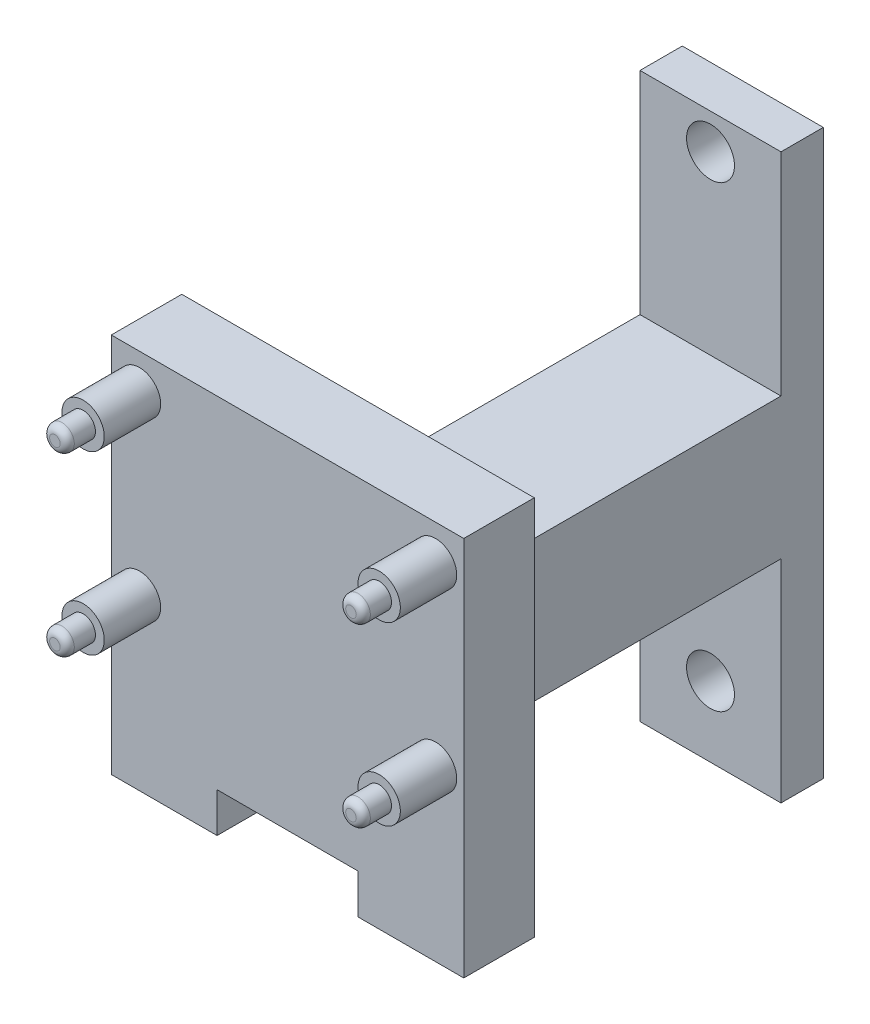
ISO-10303-21;
HEADER;
FILE_DESCRIPTION(('STEP AP214'),'2;1');
FILE_NAME('part.step','',(''),(''),'','','');
FILE_SCHEMA(('AUTOMOTIVE_DESIGN { 1 0 10303 214 1 1 1 1 }'));
ENDSEC;
DATA;
#1=APPLICATION_CONTEXT('core data for automotive mechanical design processes');
#2=APPLICATION_PROTOCOL_DEFINITION('international standard','automotive_design',2000,#1);
#3=PRODUCT_CONTEXT('',#1,'mechanical');
#4=PRODUCT('Part','Part','',(#3));
#5=PRODUCT_RELATED_PRODUCT_CATEGORY('part','',(#4));
#6=PRODUCT_DEFINITION_FORMATION('','',#4);
#7=PRODUCT_DEFINITION_CONTEXT('part definition',#1,'design');
#8=PRODUCT_DEFINITION('design','',#6,#7);
#9=PRODUCT_DEFINITION_SHAPE('','',#8);
#10=(LENGTH_UNIT() NAMED_UNIT(*) SI_UNIT(.MILLI.,.METRE.));
#11=(NAMED_UNIT(*) PLANE_ANGLE_UNIT() SI_UNIT($,.RADIAN.));
#12=(NAMED_UNIT(*) SI_UNIT($,.STERADIAN.) SOLID_ANGLE_UNIT());
#13=UNCERTAINTY_MEASURE_WITH_UNIT(LENGTH_MEASURE(1.E-05),#10,'distance_accuracy_value','');
#14=(GEOMETRIC_REPRESENTATION_CONTEXT(3) GLOBAL_UNCERTAINTY_ASSIGNED_CONTEXT((#13)) GLOBAL_UNIT_ASSIGNED_CONTEXT((#10,
#11,#12)) REPRESENTATION_CONTEXT('',''));
#15=CARTESIAN_POINT('',(0.,0.,0.));
#16=DIRECTION('',(0.,0.,1.));
#17=DIRECTION('',(1.,0.,0.));
#18=AXIS2_PLACEMENT_3D('',#15,#16,#17);
#19=CARTESIAN_POINT('',(-7.5,7.99999999999999,33.));
#20=DIRECTION('',(0.,1.,0.));
#21=DIRECTION('',(-1.,0.,0.));
#22=AXIS2_PLACEMENT_3D('',#19,#20,#21);
#23=PLANE('',#22);
#24=DIRECTION('',(0.,0.,1.));
#25=VECTOR('',#24,1.);
#26=CARTESIAN_POINT('',(10.,8.,23.));
#27=LINE('',#26,#25);
#28=CARTESIAN_POINT('',(10.,8.,28.));
#29=VERTEX_POINT('',#28);
#30=CARTESIAN_POINT('',(10.,8.,33.));
#31=VERTEX_POINT('',#30);
#32=EDGE_CURVE('E192',#29,#31,#27,.T.);
#33=ORIENTED_EDGE('',*,*,#32,.F.);
#34=DIRECTION('',(1.,0.,0.));
#35=VECTOR('',#34,1.);
#36=CARTESIAN_POINT('',(-7.5,7.99999999999999,28.));
#37=LINE('',#36,#35);
#38=CARTESIAN_POINT('',(17.5000000000001,7.99999999999996,28.));
#39=VERTEX_POINT('',#38);
#40=EDGE_CURVE('E215',#29,#39,#37,.T.);
#41=ORIENTED_EDGE('',*,*,#40,.T.);
#42=DIRECTION('',(0.,0.,-1.));
#43=VECTOR('',#42,1.);
#44=CARTESIAN_POINT('',(17.5,8.,33.));
#45=LINE('',#44,#43);
#46=CARTESIAN_POINT('',(17.5,8.,33.));
#47=VERTEX_POINT('',#46);
#48=EDGE_CURVE('E223',#47,#39,#45,.T.);
#49=ORIENTED_EDGE('',*,*,#48,.F.);
#50=DIRECTION('',(1.,0.,0.));
#51=VECTOR('',#50,1.);
#52=CARTESIAN_POINT('',(-7.5,7.99999999999999,33.));
#53=LINE('',#52,#51);
#54=EDGE_CURVE('E204',#31,#47,#53,.T.);
#55=ORIENTED_EDGE('',*,*,#54,.F.);
#56=EDGE_LOOP('',(#33,#41,#49,#55));
#57=FACE_BOUND('',#56,.T.);
#58=ADVANCED_FACE('F43',(#57),#23,.F.);
#59=CARTESIAN_POINT('',(0.,0.,33.));
#60=DIRECTION('',(0.,0.,-1.));
#61=DIRECTION('',(-1.,0.,0.));
#62=AXIS2_PLACEMENT_3D('',#59,#60,#61);
#63=PLANE('',#62);
#64=CARTESIAN_POINT('',(-5.5,32.5,33.));
#65=DIRECTION('',(0.,0.,-1.));
#66=DIRECTION('',(-1.,0.,0.));
#67=AXIS2_PLACEMENT_3D('',#64,#65,#66);
#68=CIRCLE('',#67,1.5);
#69=CARTESIAN_POINT('',(-7.,32.5,33.));
#70=VERTEX_POINT('',#69);
#71=EDGE_CURVE('E379',#70,#70,#68,.T.);
#72=ORIENTED_EDGE('',*,*,#71,.T.);
#73=EDGE_LOOP('',(#72));
#74=FACE_BOUND('',#73,.T.);
#75=CARTESIAN_POINT('',(15.5,32.5,33.));
#76=DIRECTION('',(0.,0.,-1.));
#77=DIRECTION('',(-1.,0.,0.));
#78=AXIS2_PLACEMENT_3D('',#75,#76,#77);
#79=CIRCLE('',#78,1.5);
#80=CARTESIAN_POINT('',(14.,32.5,33.));
#81=VERTEX_POINT('',#80);
#82=EDGE_CURVE('E384',#81,#81,#79,.T.);
#83=ORIENTED_EDGE('',*,*,#82,.T.);
#84=EDGE_LOOP('',(#83));
#85=FACE_BOUND('',#84,.T.);
#86=CARTESIAN_POINT('',(15.5,20.,33.));
#87=DIRECTION('',(0.,0.,-1.));
#88=DIRECTION('',(-1.,0.,0.));
#89=AXIS2_PLACEMENT_3D('',#86,#87,#88);
#90=CIRCLE('',#89,1.5);
#91=CARTESIAN_POINT('',(14.,20.,33.));
#92=VERTEX_POINT('',#91);
#93=EDGE_CURVE('E388',#92,#92,#90,.T.);
#94=ORIENTED_EDGE('',*,*,#93,.T.);
#95=EDGE_LOOP('',(#94));
#96=FACE_BOUND('',#95,.T.);
#97=CARTESIAN_POINT('',(-5.5,20.,33.));
#98=DIRECTION('',(0.,0.,-1.));
#99=DIRECTION('',(-1.,0.,0.));
#100=AXIS2_PLACEMENT_3D('',#97,#98,#99);
#101=CIRCLE('',#100,1.5);
#102=CARTESIAN_POINT('',(-7.,20.,33.));
#103=VERTEX_POINT('',#102);
#104=EDGE_CURVE('E386',#103,#103,#101,.T.);
#105=ORIENTED_EDGE('',*,*,#104,.T.);
#106=EDGE_LOOP('',(#105));
#107=FACE_BOUND('',#106,.T.);
#108=DIRECTION('',(0.,-1.,0.));
#109=VECTOR('',#108,1.);
#110=CARTESIAN_POINT('',(0.,10.8195886018041,33.));
#111=LINE('',#110,#109);
#112=CARTESIAN_POINT('',(0.,10.8195886018041,33.));
#113=VERTEX_POINT('',#112);
#114=CARTESIAN_POINT('',(0.,8.,33.));
#115=VERTEX_POINT('',#114);
#116=EDGE_CURVE('E174',#113,#115,#111,.T.);
#117=ORIENTED_EDGE('',*,*,#116,.F.);
#118=DIRECTION('',(-1.,0.,0.));
#119=VECTOR('',#118,1.);
#120=CARTESIAN_POINT('',(0.,10.8195886018041,33.));
#121=LINE('',#120,#119);
#122=CARTESIAN_POINT('',(10.,10.8195886018041,33.));
#123=VERTEX_POINT('',#122);
#124=EDGE_CURVE('E194',#123,#113,#121,.T.);
#125=ORIENTED_EDGE('',*,*,#124,.F.);
#126=DIRECTION('',(0.,1.,0.));
#127=VECTOR('',#126,1.);
#128=CARTESIAN_POINT('',(10.,10.8195886018041,33.));
#129=LINE('',#128,#127);
#130=EDGE_CURVE('E184',#31,#123,#129,.T.);
#131=ORIENTED_EDGE('',*,*,#130,.F.);
#132=ORIENTED_EDGE('',*,*,#54,.T.);
#133=DIRECTION('',(0.,1.,0.));
#134=VECTOR('',#133,1.);
#135=CARTESIAN_POINT('',(17.5,8.,33.));
#136=LINE('',#135,#134);
#137=CARTESIAN_POINT('',(17.5,35.,33.));
#138=VERTEX_POINT('',#137);
#139=EDGE_CURVE('E199',#47,#138,#136,.T.);
#140=ORIENTED_EDGE('',*,*,#139,.T.);
#141=DIRECTION('',(-1.,0.,0.));
#142=VECTOR('',#141,1.);
#143=CARTESIAN_POINT('',(-7.5,35.,33.));
#144=LINE('',#143,#142);
#145=CARTESIAN_POINT('',(-7.5,35.,33.));
#146=VERTEX_POINT('',#145);
#147=EDGE_CURVE('E205',#138,#146,#144,.T.);
#148=ORIENTED_EDGE('',*,*,#147,.T.);
#149=DIRECTION('',(0.,-1.,0.));
#150=VECTOR('',#149,1.);
#151=CARTESIAN_POINT('',(-7.5,7.99999999999999,33.));
#152=LINE('',#151,#150);
#153=CARTESIAN_POINT('',(-7.5,7.99999999999999,33.));
#154=VERTEX_POINT('',#153);
#155=EDGE_CURVE('E197',#146,#154,#152,.T.);
#156=ORIENTED_EDGE('',*,*,#155,.T.);
#157=EDGE_CURVE('E188',#154,#115,#53,.T.);
#158=ORIENTED_EDGE('',*,*,#157,.T.);
#159=EDGE_LOOP('',(#117,#125,#131,#132,#140,#148,#156,#158));
#160=FACE_BOUND('',#159,.T.);
#161=ADVANCED_FACE('F200',(#74,#85,#96,#107,#160),#63,.F.);
#162=CARTESIAN_POINT('',(0.,0.,3.));
#163=DIRECTION('',(0.,0.,-1.));
#164=DIRECTION('',(-1.,0.,0.));
#165=AXIS2_PLACEMENT_3D('',#162,#163,#164);
#166=PLANE('',#165);
#167=CARTESIAN_POINT('',(5.,37.5,3.));
#168=DIRECTION('',(0.,0.,1.));
#169=DIRECTION('',(1.,0.,0.));
#170=AXIS2_PLACEMENT_3D('',#167,#168,#169);
#171=CIRCLE('',#170,1.7);
#172=CARTESIAN_POINT('',(6.7,37.5,3.));
#173=VERTEX_POINT('',#172);
#174=EDGE_CURVE('E243',#173,#173,#171,.T.);
#175=ORIENTED_EDGE('',*,*,#174,.F.);
#176=EDGE_LOOP('',(#175));
#177=FACE_BOUND('',#176,.T.);
#178=DIRECTION('',(-1.,0.,0.));
#179=VECTOR('',#178,1.);
#180=CARTESIAN_POINT('',(0.,25.,3.));
#181=LINE('',#180,#179);
#182=CARTESIAN_POINT('',(10.,25.,3.));
#183=VERTEX_POINT('',#182);
#184=CARTESIAN_POINT('',(0.,25.,3.));
#185=VERTEX_POINT('',#184);
#186=EDGE_CURVE('E235',#183,#185,#181,.T.);
#187=ORIENTED_EDGE('',*,*,#186,.F.);
#188=DIRECTION('',(0.,1.,0.));
#189=VECTOR('',#188,1.);
#190=CARTESIAN_POINT('',(10.,0.,3.));
#191=LINE('',#190,#189);
#192=CARTESIAN_POINT('',(10.,40.,3.));
#193=VERTEX_POINT('',#192);
#194=EDGE_CURVE('E258',#183,#193,#191,.T.);
#195=ORIENTED_EDGE('',*,*,#194,.T.);
#196=DIRECTION('',(-1.,0.,0.));
#197=VECTOR('',#196,1.);
#198=CARTESIAN_POINT('',(0.,40.,3.));
#199=LINE('',#198,#197);
#200=CARTESIAN_POINT('',(0.,40.,3.));
#201=VERTEX_POINT('',#200);
#202=EDGE_CURVE('E259',#193,#201,#199,.T.);
#203=ORIENTED_EDGE('',*,*,#202,.T.);
#204=DIRECTION('',(0.,-1.,0.));
#205=VECTOR('',#204,1.);
#206=CARTESIAN_POINT('',(0.,0.,3.));
#207=LINE('',#206,#205);
#208=EDGE_CURVE('E249',#201,#185,#207,.T.);
#209=ORIENTED_EDGE('',*,*,#208,.T.);
#210=EDGE_LOOP('',(#187,#195,#203,#209));
#211=FACE_BOUND('',#210,.T.);
#212=ADVANCED_FACE('F426',(#177,#211),#166,.F.);
#213=CARTESIAN_POINT('',(5.,5.,3.));
#214=DIRECTION('',(0.,0.,1.));
#215=DIRECTION('',(1.,0.,0.));
#216=AXIS2_PLACEMENT_3D('',#213,#214,#215);
#217=CIRCLE('',#216,1.7);
#218=CARTESIAN_POINT('',(6.7,5.,3.));
#219=VERTEX_POINT('',#218);
#220=EDGE_CURVE('E242',#219,#219,#217,.T.);
#221=ORIENTED_EDGE('',*,*,#220,.F.);
#222=EDGE_LOOP('',(#221));
#223=FACE_BOUND('',#222,.T.);
#224=DIRECTION('',(1.,0.,0.));
#225=VECTOR('',#224,1.);
#226=CARTESIAN_POINT('',(0.,15.,3.));
#227=LINE('',#226,#225);
#228=CARTESIAN_POINT('',(0.,15.,3.));
#229=VERTEX_POINT('',#228);
#230=CARTESIAN_POINT('',(10.,15.,3.));
#231=VERTEX_POINT('',#230);
#232=EDGE_CURVE('E230',#229,#231,#227,.T.);
#233=ORIENTED_EDGE('',*,*,#232,.F.);
#234=CARTESIAN_POINT('',(0.,0.,3.));
#235=VERTEX_POINT('',#234);
#236=EDGE_CURVE('E251',#229,#235,#207,.T.);
#237=ORIENTED_EDGE('',*,*,#236,.T.);
#238=DIRECTION('',(1.,0.,0.));
#239=VECTOR('',#238,1.);
#240=CARTESIAN_POINT('',(0.,0.,3.));
#241=LINE('',#240,#239);
#242=CARTESIAN_POINT('',(10.,0.,3.));
#243=VERTEX_POINT('',#242);
#244=EDGE_CURVE('E254',#235,#243,#241,.T.);
#245=ORIENTED_EDGE('',*,*,#244,.T.);
#246=EDGE_CURVE('E260',#243,#231,#191,.T.);
#247=ORIENTED_EDGE('',*,*,#246,.T.);
#248=EDGE_LOOP('',(#233,#237,#245,#247));
#249=FACE_BOUND('',#248,.T.);
#250=ADVANCED_FACE('F500',(#223,#249),#166,.F.);
#251=CARTESIAN_POINT('',(0.,0.,3.));
#252=DIRECTION('',(1.,0.,0.));
#253=DIRECTION('',(0.,0.,-1.));
#254=AXIS2_PLACEMENT_3D('',#251,#252,#253);
#255=PLANE('',#254);
#256=DIRECTION('',(0.,0.,-1.));
#257=VECTOR('',#256,1.);
#258=CARTESIAN_POINT('',(0.,15.,28.));
#259=LINE('',#258,#257);
#260=CARTESIAN_POINT('',(0.,15.,20.5));
#261=VERTEX_POINT('',#260);
#262=EDGE_CURVE('E241',#261,#229,#259,.T.);
#263=ORIENTED_EDGE('',*,*,#262,.F.);
#264=DIRECTION('',(0.,1.,0.));
#265=VECTOR('',#264,1.);
#266=CARTESIAN_POINT('',(0.,0.,20.5));
#267=LINE('',#266,#265);
#268=CARTESIAN_POINT('',(0.,25.,20.5));
#269=VERTEX_POINT('',#268);
#270=EDGE_CURVE('E313',#261,#269,#267,.T.);
#271=ORIENTED_EDGE('',*,*,#270,.T.);
#272=DIRECTION('',(0.,0.,-1.));
#273=VECTOR('',#272,1.);
#274=CARTESIAN_POINT('',(0.,25.,28.));
#275=LINE('',#274,#273);
#276=EDGE_CURVE('E232',#269,#185,#275,.T.);
#277=ORIENTED_EDGE('',*,*,#276,.T.);
#278=ORIENTED_EDGE('',*,*,#208,.F.);
#279=DIRECTION('',(0.,0.,-1.));
#280=VECTOR('',#279,1.);
#281=CARTESIAN_POINT('',(0.,40.,3.));
#282=LINE('',#281,#280);
#283=CARTESIAN_POINT('',(0.,40.,0.));
#284=VERTEX_POINT('',#283);
#285=EDGE_CURVE('E265',#201,#284,#282,.T.);
#286=ORIENTED_EDGE('',*,*,#285,.T.);
#287=DIRECTION('',(0.,-1.,0.));
#288=VECTOR('',#287,1.);
#289=CARTESIAN_POINT('',(0.,0.,0.));
#290=LINE('',#289,#288);
#291=CARTESIAN_POINT('',(0.,0.,0.));
#292=VERTEX_POINT('',#291);
#293=EDGE_CURVE('E261',#284,#292,#290,.T.);
#294=ORIENTED_EDGE('',*,*,#293,.T.);
#295=DIRECTION('',(0.,0.,-1.));
#296=VECTOR('',#295,1.);
#297=CARTESIAN_POINT('',(0.,0.,3.));
#298=LINE('',#297,#296);
#299=EDGE_CURVE('E283',#235,#292,#298,.T.);
#300=ORIENTED_EDGE('',*,*,#299,.F.);
#301=ORIENTED_EDGE('',*,*,#236,.F.);
#302=EDGE_LOOP('',(#263,#271,#277,#278,#286,#294,#300,#301));
#303=FACE_BOUND('',#302,.T.);
#304=ADVANCED_FACE('F478',(#303),#255,.F.);
#305=CARTESIAN_POINT('',(0.,0.,3.));
#306=DIRECTION('',(0.,1.,0.));
#307=DIRECTION('',(0.,0.,1.));
#308=AXIS2_PLACEMENT_3D('',#305,#306,#307);
#309=PLANE('',#308);
#310=DIRECTION('',(1.,0.,0.));
#311=VECTOR('',#310,1.);
#312=CARTESIAN_POINT('',(0.,0.,0.));
#313=LINE('',#312,#311);
#314=CARTESIAN_POINT('',(10.,0.,0.));
#315=VERTEX_POINT('',#314);
#316=EDGE_CURVE('E269',#292,#315,#313,.T.);
#317=ORIENTED_EDGE('',*,*,#316,.T.);
#318=DIRECTION('',(0.,0.,-1.));
#319=VECTOR('',#318,1.);
#320=CARTESIAN_POINT('',(10.,0.,3.));
#321=LINE('',#320,#319);
#322=EDGE_CURVE('E276',#243,#315,#321,.T.);
#323=ORIENTED_EDGE('',*,*,#322,.F.);
#324=ORIENTED_EDGE('',*,*,#244,.F.);
#325=ORIENTED_EDGE('',*,*,#299,.T.);
#326=EDGE_LOOP('',(#317,#323,#324,#325));
#327=FACE_BOUND('',#326,.T.);
#328=ADVANCED_FACE('F491',(#327),#309,.F.);
#329=CARTESIAN_POINT('',(10.,0.,3.));
#330=DIRECTION('',(-1.,0.,0.));
#331=DIRECTION('',(0.,-1.,0.));
#332=AXIS2_PLACEMENT_3D('',#329,#330,#331);
#333=PLANE('',#332);
#334=DIRECTION('',(0.,0.,-1.));
#335=VECTOR('',#334,1.);
#336=CARTESIAN_POINT('',(10.,25.,28.));
#337=LINE('',#336,#335);
#338=CARTESIAN_POINT('',(10.,25.,20.5));
#339=VERTEX_POINT('',#338);
#340=EDGE_CURVE('E240',#339,#183,#337,.T.);
#341=ORIENTED_EDGE('',*,*,#340,.F.);
#342=DIRECTION('',(0.,-1.,0.));
#343=VECTOR('',#342,1.);
#344=CARTESIAN_POINT('',(10.,0.,20.5));
#345=LINE('',#344,#343);
#346=CARTESIAN_POINT('',(10.,15.,20.5));
#347=VERTEX_POINT('',#346);
#348=EDGE_CURVE('E317',#339,#347,#345,.T.);
#349=ORIENTED_EDGE('',*,*,#348,.T.);
#350=DIRECTION('',(0.,0.,-1.));
#351=VECTOR('',#350,1.);
#352=CARTESIAN_POINT('',(10.,15.,28.));
#353=LINE('',#352,#351);
#354=EDGE_CURVE('E237',#347,#231,#353,.T.);
#355=ORIENTED_EDGE('',*,*,#354,.T.);
#356=ORIENTED_EDGE('',*,*,#246,.F.);
#357=ORIENTED_EDGE('',*,*,#322,.T.);
#358=DIRECTION('',(0.,1.,0.));
#359=VECTOR('',#358,1.);
#360=CARTESIAN_POINT('',(10.,0.,0.));
#361=LINE('',#360,#359);
#362=CARTESIAN_POINT('',(10.,40.,0.));
#363=VERTEX_POINT('',#362);
#364=EDGE_CURVE('E268',#315,#363,#361,.T.);
#365=ORIENTED_EDGE('',*,*,#364,.T.);
#366=DIRECTION('',(0.,0.,-1.));
#367=VECTOR('',#366,1.);
#368=CARTESIAN_POINT('',(10.,40.,3.));
#369=LINE('',#368,#367);
#370=EDGE_CURVE('E273',#193,#363,#369,.T.);
#371=ORIENTED_EDGE('',*,*,#370,.F.);
#372=ORIENTED_EDGE('',*,*,#194,.F.);
#373=EDGE_LOOP('',(#341,#349,#355,#356,#357,#365,#371,#372));
#374=FACE_BOUND('',#373,.T.);
#375=ADVANCED_FACE('F504',(#374),#333,.F.);
#376=CARTESIAN_POINT('',(0.,40.,3.));
#377=DIRECTION('',(0.,-1.,0.));
#378=DIRECTION('',(0.,0.,-1.));
#379=AXIS2_PLACEMENT_3D('',#376,#377,#378);
#380=PLANE('',#379);
#381=DIRECTION('',(-1.,0.,0.));
#382=VECTOR('',#381,1.);
#383=CARTESIAN_POINT('',(0.,40.,0.));
#384=LINE('',#383,#382);
#385=EDGE_CURVE('E272',#363,#284,#384,.T.);
#386=ORIENTED_EDGE('',*,*,#385,.T.);
#387=ORIENTED_EDGE('',*,*,#285,.F.);
#388=ORIENTED_EDGE('',*,*,#202,.F.);
#389=ORIENTED_EDGE('',*,*,#370,.T.);
#390=EDGE_LOOP('',(#386,#387,#388,#389));
#391=FACE_BOUND('',#390,.T.);
#392=ADVANCED_FACE('F485',(#391),#380,.F.);
#393=CARTESIAN_POINT('',(0.,0.,0.));
#394=DIRECTION('',(0.,0.,-1.));
#395=DIRECTION('',(-1.,0.,0.));
#396=AXIS2_PLACEMENT_3D('',#393,#394,#395);
#397=PLANE('',#396);
#398=CARTESIAN_POINT('',(5.,5.,0.));
#399=DIRECTION('',(0.,0.,-1.));
#400=DIRECTION('',(-1.,0.,0.));
#401=AXIS2_PLACEMENT_3D('',#398,#399,#400);
#402=CIRCLE('',#401,1.7);
#403=CARTESIAN_POINT('',(3.3,5.,0.));
#404=VERTEX_POINT('',#403);
#405=EDGE_CURVE('E266',#404,#404,#402,.T.);
#406=ORIENTED_EDGE('',*,*,#405,.F.);
#407=EDGE_LOOP('',(#406));
#408=FACE_BOUND('',#407,.T.);
#409=CARTESIAN_POINT('',(5.,37.5,0.));
#410=DIRECTION('',(0.,0.,-1.));
#411=DIRECTION('',(-1.,0.,0.));
#412=AXIS2_PLACEMENT_3D('',#409,#410,#411);
#413=CIRCLE('',#412,1.7);
#414=CARTESIAN_POINT('',(3.3,37.5,0.));
#415=VERTEX_POINT('',#414);
#416=EDGE_CURVE('E250',#415,#415,#413,.T.);
#417=ORIENTED_EDGE('',*,*,#416,.F.);
#418=EDGE_LOOP('',(#417));
#419=FACE_BOUND('',#418,.T.);
#420=ORIENTED_EDGE('',*,*,#293,.F.);
#421=ORIENTED_EDGE('',*,*,#385,.F.);
#422=ORIENTED_EDGE('',*,*,#364,.F.);
#423=ORIENTED_EDGE('',*,*,#316,.F.);
#424=EDGE_LOOP('',(#420,#421,#422,#423));
#425=FACE_BOUND('',#424,.T.);
#426=ADVANCED_FACE('F486',(#408,#419,#425),#397,.T.);
#427=CARTESIAN_POINT('',(5.,37.5,-4.));
#428=DIRECTION('',(0.,0.,1.));
#429=DIRECTION('',(1.,0.,0.));
#430=AXIS2_PLACEMENT_3D('',#427,#428,#429);
#431=CYLINDRICAL_SURFACE('',#430,1.7);
#432=ORIENTED_EDGE('',*,*,#416,.T.);
#433=EDGE_LOOP('',(#432));
#434=FACE_BOUND('',#433,.T.);
#435=ORIENTED_EDGE('',*,*,#174,.T.);
#436=EDGE_LOOP('',(#435));
#437=FACE_BOUND('',#436,.T.);
#438=ADVANCED_FACE('F882',(#434,#437),#431,.F.);
#439=CARTESIAN_POINT('',(5.,5.,-4.));
#440=DIRECTION('',(0.,0.,1.));
#441=DIRECTION('',(1.,0.,0.));
#442=AXIS2_PLACEMENT_3D('',#439,#440,#441);
#443=CYLINDRICAL_SURFACE('',#442,1.7);
#444=ORIENTED_EDGE('',*,*,#405,.T.);
#445=EDGE_LOOP('',(#444));
#446=FACE_BOUND('',#445,.T.);
#447=ORIENTED_EDGE('',*,*,#220,.T.);
#448=EDGE_LOOP('',(#447));
#449=FACE_BOUND('',#448,.T.);
#450=ADVANCED_FACE('F755',(#446,#449),#443,.F.);
#451=CARTESIAN_POINT('',(0.,15.,28.));
#452=DIRECTION('',(0.,1.,0.));
#453=DIRECTION('',(0.,0.,1.));
#454=AXIS2_PLACEMENT_3D('',#451,#452,#453);
#455=PLANE('',#454);
#456=DIRECTION('',(0.707106781186551,0.,0.707106781186544));
#457=VECTOR('',#456,1.);
#458=CARTESIAN_POINT('',(8.74999999999994,15.,19.25));
#459=LINE('',#458,#457);
#460=CARTESIAN_POINT('',(10.5,15.,21.));
#461=VERTEX_POINT('',#460);
#462=EDGE_CURVE('E324',#347,#461,#459,.T.);
#463=ORIENTED_EDGE('',*,*,#462,.T.);
#464=DIRECTION('',(-1.,0.,0.));
#465=VECTOR('',#464,1.);
#466=CARTESIAN_POINT('',(0.,15.,21.));
#467=LINE('',#466,#465);
#468=CARTESIAN_POINT('',(-0.499999999999997,15.,21.));
#469=VERTEX_POINT('',#468);
#470=EDGE_CURVE('E335',#461,#469,#467,.T.);
#471=ORIENTED_EDGE('',*,*,#470,.T.);
#472=DIRECTION('',(0.707106781186551,0.,-0.707106781186544));
#473=VECTOR('',#472,1.);
#474=CARTESIAN_POINT('',(-3.74999999999998,15.,24.25));
#475=LINE('',#474,#473);
#476=EDGE_CURVE('E319',#469,#261,#475,.T.);
#477=ORIENTED_EDGE('',*,*,#476,.T.);
#478=ORIENTED_EDGE('',*,*,#262,.T.);
#479=ORIENTED_EDGE('',*,*,#232,.T.);
#480=ORIENTED_EDGE('',*,*,#354,.F.);
#481=EDGE_LOOP('',(#463,#471,#477,#478,#479,#480));
#482=FACE_BOUND('',#481,.T.);
#483=ADVANCED_FACE('F450',(#482),#455,.F.);
#484=CARTESIAN_POINT('',(0.,25.,28.));
#485=DIRECTION('',(0.,-1.,0.));
#486=DIRECTION('',(1.,0.,0.));
#487=AXIS2_PLACEMENT_3D('',#484,#485,#486);
#488=PLANE('',#487);
#489=DIRECTION('',(-0.707106781186551,0.,0.707106781186544));
#490=VECTOR('',#489,1.);
#491=CARTESIAN_POINT('',(-3.74999999999999,25.,24.25));
#492=LINE('',#491,#490);
#493=CARTESIAN_POINT('',(-0.500000000000012,25.,21.));
#494=VERTEX_POINT('',#493);
#495=EDGE_CURVE('E318',#269,#494,#492,.T.);
#496=ORIENTED_EDGE('',*,*,#495,.T.);
#497=DIRECTION('',(1.,0.,0.));
#498=VECTOR('',#497,1.);
#499=CARTESIAN_POINT('',(0.,25.,21.));
#500=LINE('',#499,#498);
#501=CARTESIAN_POINT('',(10.5,25.,21.));
#502=VERTEX_POINT('',#501);
#503=EDGE_CURVE('E334',#494,#502,#500,.T.);
#504=ORIENTED_EDGE('',*,*,#503,.T.);
#505=DIRECTION('',(-0.707106781186551,0.,-0.707106781186544));
#506=VECTOR('',#505,1.);
#507=CARTESIAN_POINT('',(8.74999999999994,25.,19.25));
#508=LINE('',#507,#506);
#509=EDGE_CURVE('E321',#502,#339,#508,.T.);
#510=ORIENTED_EDGE('',*,*,#509,.T.);
#511=ORIENTED_EDGE('',*,*,#340,.T.);
#512=ORIENTED_EDGE('',*,*,#186,.T.);
#513=ORIENTED_EDGE('',*,*,#276,.F.);
#514=EDGE_LOOP('',(#496,#504,#510,#511,#512,#513));
#515=FACE_BOUND('',#514,.T.);
#516=ADVANCED_FACE('F441',(#515),#488,.F.);
#517=CARTESIAN_POINT('',(0.,0.,28.));
#518=DIRECTION('',(0.,0.,-1.));
#519=DIRECTION('',(-1.,0.,0.));
#520=AXIS2_PLACEMENT_3D('',#517,#518,#519);
#521=PLANE('',#520);
#522=DIRECTION('',(0.,1.,0.));
#523=VECTOR('',#522,1.);
#524=CARTESIAN_POINT('',(17.5,35.,28.));
#525=LINE('',#524,#523);
#526=CARTESIAN_POINT('',(17.5,32.0000000000001,28.));
#527=VERTEX_POINT('',#526);
#528=CARTESIAN_POINT('',(17.5,35.,28.));
#529=VERTEX_POINT('',#528);
#530=EDGE_CURVE('E213',#527,#529,#525,.T.);
#531=ORIENTED_EDGE('',*,*,#530,.F.);
#532=DIRECTION('',(-1.,0.,0.));
#533=VECTOR('',#532,1.);
#534=CARTESIAN_POINT('',(0.,32.,28.));
#535=LINE('',#534,#533);
#536=CARTESIAN_POINT('',(-7.50000000000001,32.,28.));
#537=VERTEX_POINT('',#536);
#538=EDGE_CURVE('E326',#527,#537,#535,.T.);
#539=ORIENTED_EDGE('',*,*,#538,.T.);
#540=DIRECTION('',(0.,-1.,0.));
#541=VECTOR('',#540,1.);
#542=CARTESIAN_POINT('',(-7.50000000000001,32.,28.));
#543=LINE('',#542,#541);
#544=CARTESIAN_POINT('',(-7.5,35.,28.));
#545=VERTEX_POINT('',#544);
#546=EDGE_CURVE('E220',#545,#537,#543,.T.);
#547=ORIENTED_EDGE('',*,*,#546,.F.);
#548=DIRECTION('',(-1.,0.,0.));
#549=VECTOR('',#548,1.);
#550=CARTESIAN_POINT('',(-7.5,35.,28.));
#551=LINE('',#550,#549);
#552=EDGE_CURVE('E214',#529,#545,#551,.T.);
#553=ORIENTED_EDGE('',*,*,#552,.F.);
#554=EDGE_LOOP('',(#531,#539,#547,#553));
#555=FACE_BOUND('',#554,.T.);
#556=ADVANCED_FACE('F432',(#555),#521,.T.);
#557=CARTESIAN_POINT('',(-7.5,7.99999999999999,28.));
#558=VERTEX_POINT('',#557);
#559=CARTESIAN_POINT('',(0.,8.,28.));
#560=VERTEX_POINT('',#559);
#561=EDGE_CURVE('E191',#558,#560,#37,.T.);
#562=ORIENTED_EDGE('',*,*,#561,.T.);
#563=DIRECTION('',(0.,0.,1.));
#564=VECTOR('',#563,1.);
#565=CARTESIAN_POINT('',(0.,8.,23.));
#566=LINE('',#565,#564);
#567=EDGE_CURVE('E178',#560,#115,#566,.T.);
#568=ORIENTED_EDGE('',*,*,#567,.T.);
#569=ORIENTED_EDGE('',*,*,#157,.F.);
#570=DIRECTION('',(0.,0.,-1.));
#571=VECTOR('',#570,1.);
#572=CARTESIAN_POINT('',(-7.5,7.99999999999999,33.));
#573=LINE('',#572,#571);
#574=EDGE_CURVE('E227',#154,#558,#573,.T.);
#575=ORIENTED_EDGE('',*,*,#574,.T.);
#576=EDGE_LOOP('',(#562,#568,#569,#575));
#577=FACE_BOUND('',#576,.T.);
#578=ADVANCED_FACE('F186',(#577),#23,.F.);
#579=CARTESIAN_POINT('',(17.5,35.,33.));
#580=DIRECTION('',(-1.,0.,0.));
#581=DIRECTION('',(0.,-1.,0.));
#582=AXIS2_PLACEMENT_3D('',#579,#580,#581);
#583=PLANE('',#582);
#584=ORIENTED_EDGE('',*,*,#48,.T.);
#585=EDGE_CURVE('E212',#39,#527,#525,.T.);
#586=ORIENTED_EDGE('',*,*,#585,.T.);
#587=ORIENTED_EDGE('',*,*,#530,.T.);
#588=DIRECTION('',(0.,0.,-1.));
#589=VECTOR('',#588,1.);
#590=CARTESIAN_POINT('',(17.5,35.,33.));
#591=LINE('',#590,#589);
#592=EDGE_CURVE('E224',#138,#529,#591,.T.);
#593=ORIENTED_EDGE('',*,*,#592,.F.);
#594=ORIENTED_EDGE('',*,*,#139,.F.);
#595=EDGE_LOOP('',(#584,#586,#587,#593,#594));
#596=FACE_BOUND('',#595,.T.);
#597=ADVANCED_FACE('F407',(#596),#583,.F.);
#598=CARTESIAN_POINT('',(-7.5,35.,33.));
#599=DIRECTION('',(0.,-1.,0.));
#600=DIRECTION('',(0.,0.,-1.));
#601=AXIS2_PLACEMENT_3D('',#598,#599,#600);
#602=PLANE('',#601);
#603=ORIENTED_EDGE('',*,*,#552,.T.);
#604=DIRECTION('',(0.,0.,-1.));
#605=VECTOR('',#604,1.);
#606=CARTESIAN_POINT('',(-7.5,35.,33.));
#607=LINE('',#606,#605);
#608=EDGE_CURVE('E209',#146,#545,#607,.T.);
#609=ORIENTED_EDGE('',*,*,#608,.F.);
#610=ORIENTED_EDGE('',*,*,#147,.F.);
#611=ORIENTED_EDGE('',*,*,#592,.T.);
#612=EDGE_LOOP('',(#603,#609,#610,#611));
#613=FACE_BOUND('',#612,.T.);
#614=ADVANCED_FACE('F437',(#613),#602,.F.);
#615=CARTESIAN_POINT('',(-7.50000000000001,32.,33.));
#616=DIRECTION('',(1.,0.,0.));
#617=DIRECTION('',(0.,1.,0.));
#618=AXIS2_PLACEMENT_3D('',#615,#616,#617);
#619=PLANE('',#618);
#620=ORIENTED_EDGE('',*,*,#546,.T.);
#621=EDGE_CURVE('E70',#537,#558,#543,.T.);
#622=ORIENTED_EDGE('',*,*,#621,.T.);
#623=ORIENTED_EDGE('',*,*,#574,.F.);
#624=ORIENTED_EDGE('',*,*,#155,.F.);
#625=ORIENTED_EDGE('',*,*,#608,.T.);
#626=EDGE_LOOP('',(#620,#622,#623,#624,#625));
#627=FACE_BOUND('',#626,.T.);
#628=ADVANCED_FACE('F453',(#627),#619,.F.);
#629=CARTESIAN_POINT('',(-5.5,32.5,37.));
#630=DIRECTION('',(0.,0.,-1.));
#631=DIRECTION('',(-1.,0.,0.));
#632=AXIS2_PLACEMENT_3D('',#629,#630,#631);
#633=CYLINDRICAL_SURFACE('',#632,1.5);
#634=CARTESIAN_POINT('',(-5.5,32.5,37.));
#635=DIRECTION('',(0.,0.,-1.));
#636=DIRECTION('',(-1.,0.,0.));
#637=AXIS2_PLACEMENT_3D('',#634,#635,#636);
#638=CIRCLE('',#637,1.5);
#639=CARTESIAN_POINT('',(-7.,32.5,37.));
#640=VERTEX_POINT('',#639);
#641=EDGE_CURVE('E374',#640,#640,#638,.T.);
#642=ORIENTED_EDGE('',*,*,#641,.T.);
#643=EDGE_LOOP('',(#642));
#644=FACE_BOUND('',#643,.T.);
#645=ORIENTED_EDGE('',*,*,#71,.F.);
#646=EDGE_LOOP('',(#645));
#647=FACE_BOUND('',#646,.T.);
#648=ADVANCED_FACE('F452',(#644,#647),#633,.T.);
#649=CARTESIAN_POINT('',(-5.5,32.5,37.));
#650=DIRECTION('',(0.,0.,-1.));
#651=DIRECTION('',(-1.,0.,0.));
#652=AXIS2_PLACEMENT_3D('',#649,#650,#651);
#653=PLANE('',#652);
#654=CARTESIAN_POINT('',(-5.5,32.5,37.));
#655=DIRECTION('',(0.,0.,1.));
#656=DIRECTION('',(1.,0.,0.));
#657=AXIS2_PLACEMENT_3D('',#654,#655,#656);
#658=CIRCLE('',#657,0.875);
#659=CARTESIAN_POINT('',(-4.625,32.5,37.));
#660=VERTEX_POINT('',#659);
#661=EDGE_CURVE('E291',#660,#660,#658,.T.);
#662=ORIENTED_EDGE('',*,*,#661,.F.);
#663=EDGE_LOOP('',(#662));
#664=FACE_BOUND('',#663,.T.);
#665=ORIENTED_EDGE('',*,*,#641,.F.);
#666=EDGE_LOOP('',(#665));
#667=FACE_BOUND('',#666,.T.);
#668=ADVANCED_FACE('F591',(#664,#667),#653,.F.);
#669=CARTESIAN_POINT('',(15.5,32.5,37.));
#670=DIRECTION('',(0.,0.,-1.));
#671=DIRECTION('',(-1.,0.,0.));
#672=AXIS2_PLACEMENT_3D('',#669,#670,#671);
#673=CYLINDRICAL_SURFACE('',#672,1.5);
#674=CARTESIAN_POINT('',(15.5,32.5,37.));
#675=DIRECTION('',(0.,0.,-1.));
#676=DIRECTION('',(-1.,0.,0.));
#677=AXIS2_PLACEMENT_3D('',#674,#675,#676);
#678=CIRCLE('',#677,1.5);
#679=CARTESIAN_POINT('',(14.,32.5,37.));
#680=VERTEX_POINT('',#679);
#681=EDGE_CURVE('E375',#680,#680,#678,.T.);
#682=ORIENTED_EDGE('',*,*,#681,.T.);
#683=EDGE_LOOP('',(#682));
#684=FACE_BOUND('',#683,.T.);
#685=ORIENTED_EDGE('',*,*,#82,.F.);
#686=EDGE_LOOP('',(#685));
#687=FACE_BOUND('',#686,.T.);
#688=ADVANCED_FACE('F586',(#684,#687),#673,.T.);
#689=CARTESIAN_POINT('',(15.5,32.5,37.));
#690=DIRECTION('',(0.,0.,-1.));
#691=DIRECTION('',(-1.,0.,0.));
#692=AXIS2_PLACEMENT_3D('',#689,#690,#691);
#693=PLANE('',#692);
#694=CARTESIAN_POINT('',(15.5,32.5,37.));
#695=DIRECTION('',(0.,0.,1.));
#696=DIRECTION('',(1.,0.,0.));
#697=AXIS2_PLACEMENT_3D('',#694,#695,#696);
#698=CIRCLE('',#697,0.875000000000002);
#699=CARTESIAN_POINT('',(16.375,32.5,37.));
#700=VERTEX_POINT('',#699);
#701=EDGE_CURVE('E365',#700,#700,#698,.T.);
#702=ORIENTED_EDGE('',*,*,#701,.F.);
#703=EDGE_LOOP('',(#702));
#704=FACE_BOUND('',#703,.T.);
#705=ORIENTED_EDGE('',*,*,#681,.F.);
#706=EDGE_LOOP('',(#705));
#707=FACE_BOUND('',#706,.T.);
#708=ADVANCED_FACE('F594',(#704,#707),#693,.F.);
#709=CARTESIAN_POINT('',(15.5,20.,37.));
#710=DIRECTION('',(0.,0.,-1.));
#711=DIRECTION('',(-1.,0.,0.));
#712=AXIS2_PLACEMENT_3D('',#709,#710,#711);
#713=CYLINDRICAL_SURFACE('',#712,1.5);
#714=CARTESIAN_POINT('',(15.5,20.,37.));
#715=DIRECTION('',(0.,0.,-1.));
#716=DIRECTION('',(-1.,0.,0.));
#717=AXIS2_PLACEMENT_3D('',#714,#715,#716);
#718=CIRCLE('',#717,1.5);
#719=CARTESIAN_POINT('',(14.,20.,37.));
#720=VERTEX_POINT('',#719);
#721=EDGE_CURVE('E352',#720,#720,#718,.T.);
#722=ORIENTED_EDGE('',*,*,#721,.T.);
#723=EDGE_LOOP('',(#722));
#724=FACE_BOUND('',#723,.T.);
#725=ORIENTED_EDGE('',*,*,#93,.F.);
#726=EDGE_LOOP('',(#725));
#727=FACE_BOUND('',#726,.T.);
#728=ADVANCED_FACE('F597',(#724,#727),#713,.T.);
#729=CARTESIAN_POINT('',(15.5,20.,37.));
#730=DIRECTION('',(0.,0.,-1.));
#731=DIRECTION('',(-1.,0.,0.));
#732=AXIS2_PLACEMENT_3D('',#729,#730,#731);
#733=PLANE('',#732);
#734=CARTESIAN_POINT('',(15.5,20.,37.));
#735=DIRECTION('',(0.,0.,1.));
#736=DIRECTION('',(1.,0.,0.));
#737=AXIS2_PLACEMENT_3D('',#734,#735,#736);
#738=CIRCLE('',#737,0.875);
#739=CARTESIAN_POINT('',(16.375,20.,37.));
#740=VERTEX_POINT('',#739);
#741=EDGE_CURVE('E362',#740,#740,#738,.T.);
#742=ORIENTED_EDGE('',*,*,#741,.F.);
#743=EDGE_LOOP('',(#742));
#744=FACE_BOUND('',#743,.T.);
#745=ORIENTED_EDGE('',*,*,#721,.F.);
#746=EDGE_LOOP('',(#745));
#747=FACE_BOUND('',#746,.T.);
#748=ADVANCED_FACE('F598',(#744,#747),#733,.F.);
#749=CARTESIAN_POINT('',(-5.5,20.,37.));
#750=DIRECTION('',(0.,0.,-1.));
#751=DIRECTION('',(-1.,0.,0.));
#752=AXIS2_PLACEMENT_3D('',#749,#750,#751);
#753=CYLINDRICAL_SURFACE('',#752,1.5);
#754=CARTESIAN_POINT('',(-5.5,20.,37.));
#755=DIRECTION('',(0.,0.,-1.));
#756=DIRECTION('',(-1.,0.,0.));
#757=AXIS2_PLACEMENT_3D('',#754,#755,#756);
#758=CIRCLE('',#757,1.5);
#759=CARTESIAN_POINT('',(-7.,20.,37.));
#760=VERTEX_POINT('',#759);
#761=EDGE_CURVE('E351',#760,#760,#758,.T.);
#762=ORIENTED_EDGE('',*,*,#761,.T.);
#763=EDGE_LOOP('',(#762));
#764=FACE_BOUND('',#763,.T.);
#765=ORIENTED_EDGE('',*,*,#104,.F.);
#766=EDGE_LOOP('',(#765));
#767=FACE_BOUND('',#766,.T.);
#768=ADVANCED_FACE('F602',(#764,#767),#753,.T.);
#769=CARTESIAN_POINT('',(-5.5,20.,37.));
#770=DIRECTION('',(0.,0.,-1.));
#771=DIRECTION('',(-1.,0.,0.));
#772=AXIS2_PLACEMENT_3D('',#769,#770,#771);
#773=PLANE('',#772);
#774=CARTESIAN_POINT('',(-5.5,20.,37.));
#775=DIRECTION('',(0.,0.,1.));
#776=DIRECTION('',(1.,0.,0.));
#777=AXIS2_PLACEMENT_3D('',#774,#775,#776);
#778=CIRCLE('',#777,0.875);
#779=CARTESIAN_POINT('',(-4.625,20.,37.));
#780=VERTEX_POINT('',#779);
#781=EDGE_CURVE('E282',#780,#780,#778,.T.);
#782=ORIENTED_EDGE('',*,*,#781,.F.);
#783=EDGE_LOOP('',(#782));
#784=FACE_BOUND('',#783,.T.);
#785=ORIENTED_EDGE('',*,*,#761,.F.);
#786=EDGE_LOOP('',(#785));
#787=FACE_BOUND('',#786,.T.);
#788=ADVANCED_FACE('F580',(#784,#787),#773,.F.);
#789=CARTESIAN_POINT('',(-5.5,20.,39.));
#790=DIRECTION('',(0.,0.,-1.));
#791=DIRECTION('',(-1.,0.,0.));
#792=AXIS2_PLACEMENT_3D('',#789,#790,#791);
#793=CYLINDRICAL_SURFACE('',#792,0.875);
#794=CARTESIAN_POINT('',(-5.5,20.,38.5));
#795=DIRECTION('',(0.,0.,1.));
#796=DIRECTION('',(1.,0.,0.));
#797=AXIS2_PLACEMENT_3D('',#794,#795,#796);
#798=CIRCLE('',#797,0.875);
#799=CARTESIAN_POINT('',(-4.625,20.,38.5));
#800=VERTEX_POINT('',#799);
#801=EDGE_CURVE('E304',#800,#800,#798,.F.);
#802=ORIENTED_EDGE('',*,*,#801,.T.);
#803=EDGE_LOOP('',(#802));
#804=FACE_BOUND('',#803,.T.);
#805=ORIENTED_EDGE('',*,*,#781,.T.);
#806=EDGE_LOOP('',(#805));
#807=FACE_BOUND('',#806,.T.);
#808=ADVANCED_FACE('F573',(#804,#807),#793,.T.);
#809=CARTESIAN_POINT('',(-5.5,20.,39.));
#810=DIRECTION('',(0.,0.,1.));
#811=DIRECTION('',(1.,0.,0.));
#812=AXIS2_PLACEMENT_3D('',#809,#810,#811);
#813=PLANE('',#812);
#814=CARTESIAN_POINT('',(-5.5,20.,39.));
#815=DIRECTION('',(0.,0.,1.));
#816=DIRECTION('',(1.,0.,0.));
#817=AXIS2_PLACEMENT_3D('',#814,#815,#816);
#818=CIRCLE('',#817,0.375);
#819=CARTESIAN_POINT('',(-5.125,20.,39.));
#820=VERTEX_POINT('',#819);
#821=EDGE_CURVE('E305',#820,#820,#818,.T.);
#822=ORIENTED_EDGE('',*,*,#821,.T.);
#823=EDGE_LOOP('',(#822));
#824=FACE_BOUND('',#823,.T.);
#825=ADVANCED_FACE('F567',(#824),#813,.T.);
#826=CARTESIAN_POINT('',(15.5,20.,39.));
#827=DIRECTION('',(0.,0.,-1.));
#828=DIRECTION('',(-1.,0.,0.));
#829=AXIS2_PLACEMENT_3D('',#826,#827,#828);
#830=CYLINDRICAL_SURFACE('',#829,0.875);
#831=CARTESIAN_POINT('',(15.5,20.,38.5));
#832=DIRECTION('',(0.,0.,1.));
#833=DIRECTION('',(1.,0.,0.));
#834=AXIS2_PLACEMENT_3D('',#831,#832,#833);
#835=CIRCLE('',#834,0.875);
#836=CARTESIAN_POINT('',(16.375,20.,38.5));
#837=VERTEX_POINT('',#836);
#838=EDGE_CURVE('E299',#837,#837,#835,.F.);
#839=ORIENTED_EDGE('',*,*,#838,.T.);
#840=EDGE_LOOP('',(#839));
#841=FACE_BOUND('',#840,.T.);
#842=ORIENTED_EDGE('',*,*,#741,.T.);
#843=EDGE_LOOP('',(#842));
#844=FACE_BOUND('',#843,.T.);
#845=ADVANCED_FACE('F566',(#841,#844),#830,.T.);
#846=CARTESIAN_POINT('',(15.5,20.,39.));
#847=DIRECTION('',(0.,0.,1.));
#848=DIRECTION('',(1.,0.,0.));
#849=AXIS2_PLACEMENT_3D('',#846,#847,#848);
#850=PLANE('',#849);
#851=CARTESIAN_POINT('',(15.5,20.,39.));
#852=DIRECTION('',(0.,0.,1.));
#853=DIRECTION('',(1.,0.,0.));
#854=AXIS2_PLACEMENT_3D('',#851,#852,#853);
#855=CIRCLE('',#854,0.375);
#856=CARTESIAN_POINT('',(15.875,20.,39.));
#857=VERTEX_POINT('',#856);
#858=EDGE_CURVE('E298',#857,#857,#855,.T.);
#859=ORIENTED_EDGE('',*,*,#858,.T.);
#860=EDGE_LOOP('',(#859));
#861=FACE_BOUND('',#860,.T.);
#862=ADVANCED_FACE('F557',(#861),#850,.T.);
#863=CARTESIAN_POINT('',(15.5,32.5,39.));
#864=DIRECTION('',(0.,0.,-1.));
#865=DIRECTION('',(-1.,0.,0.));
#866=AXIS2_PLACEMENT_3D('',#863,#864,#865);
#867=CYLINDRICAL_SURFACE('',#866,0.875000000000002);
#868=CARTESIAN_POINT('',(15.5,32.5,38.5));
#869=DIRECTION('',(0.,0.,1.));
#870=DIRECTION('',(1.,0.,0.));
#871=AXIS2_PLACEMENT_3D('',#868,#869,#870);
#872=CIRCLE('',#871,0.875000000000002);
#873=CARTESIAN_POINT('',(16.375,32.5,38.5));
#874=VERTEX_POINT('',#873);
#875=EDGE_CURVE('E292',#874,#874,#872,.F.);
#876=ORIENTED_EDGE('',*,*,#875,.T.);
#877=EDGE_LOOP('',(#876));
#878=FACE_BOUND('',#877,.T.);
#879=ORIENTED_EDGE('',*,*,#701,.T.);
#880=EDGE_LOOP('',(#879));
#881=FACE_BOUND('',#880,.T.);
#882=ADVANCED_FACE('F558',(#878,#881),#867,.T.);
#883=CARTESIAN_POINT('',(15.5,32.5,39.));
#884=DIRECTION('',(0.,0.,1.));
#885=DIRECTION('',(1.,0.,0.));
#886=AXIS2_PLACEMENT_3D('',#883,#884,#885);
#887=PLANE('',#886);
#888=CARTESIAN_POINT('',(15.5,32.5,39.));
#889=DIRECTION('',(0.,0.,1.));
#890=DIRECTION('',(1.,0.,0.));
#891=AXIS2_PLACEMENT_3D('',#888,#889,#890);
#892=CIRCLE('',#891,0.375000000000002);
#893=CARTESIAN_POINT('',(15.875,32.5,39.));
#894=VERTEX_POINT('',#893);
#895=EDGE_CURVE('E288',#894,#894,#892,.T.);
#896=ORIENTED_EDGE('',*,*,#895,.T.);
#897=EDGE_LOOP('',(#896));
#898=FACE_BOUND('',#897,.T.);
#899=ADVANCED_FACE('F559',(#898),#887,.T.);
#900=CARTESIAN_POINT('',(-5.5,32.5,39.));
#901=DIRECTION('',(0.,0.,-1.));
#902=DIRECTION('',(-1.,0.,0.));
#903=AXIS2_PLACEMENT_3D('',#900,#901,#902);
#904=CYLINDRICAL_SURFACE('',#903,0.875);
#905=CARTESIAN_POINT('',(-5.5,32.5,38.5));
#906=DIRECTION('',(0.,0.,1.));
#907=DIRECTION('',(1.,0.,0.));
#908=AXIS2_PLACEMENT_3D('',#905,#906,#907);
#909=CIRCLE('',#908,0.875);
#910=CARTESIAN_POINT('',(-4.625,32.5,38.5));
#911=VERTEX_POINT('',#910);
#912=EDGE_CURVE('E311',#911,#911,#909,.F.);
#913=ORIENTED_EDGE('',*,*,#912,.T.);
#914=EDGE_LOOP('',(#913));
#915=FACE_BOUND('',#914,.T.);
#916=ORIENTED_EDGE('',*,*,#661,.T.);
#917=EDGE_LOOP('',(#916));
#918=FACE_BOUND('',#917,.T.);
#919=ADVANCED_FACE('F562',(#915,#918),#904,.T.);
#920=CARTESIAN_POINT('',(-5.5,32.5,39.));
#921=DIRECTION('',(0.,0.,1.));
#922=DIRECTION('',(1.,0.,0.));
#923=AXIS2_PLACEMENT_3D('',#920,#921,#922);
#924=PLANE('',#923);
#925=CARTESIAN_POINT('',(-5.5,32.5,39.));
#926=DIRECTION('',(0.,0.,1.));
#927=DIRECTION('',(1.,0.,0.));
#928=AXIS2_PLACEMENT_3D('',#925,#926,#927);
#929=CIRCLE('',#928,0.375);
#930=CARTESIAN_POINT('',(-5.125,32.5,39.));
#931=VERTEX_POINT('',#930);
#932=EDGE_CURVE('E308',#931,#931,#929,.T.);
#933=ORIENTED_EDGE('',*,*,#932,.T.);
#934=EDGE_LOOP('',(#933));
#935=FACE_BOUND('',#934,.T.);
#936=ADVANCED_FACE('F521',(#935),#924,.T.);
#937=CARTESIAN_POINT('',(15.5,32.5,38.5));
#938=DIRECTION('',(0.,0.,1.));
#939=DIRECTION('',(1.,0.,0.));
#940=AXIS2_PLACEMENT_3D('',#937,#938,#939);
#941=DEGENERATE_TOROIDAL_SURFACE('',#940,0.375000000000002,0.5,.T.);
#942=ORIENTED_EDGE('',*,*,#875,.F.);
#943=EDGE_LOOP('',(#942));
#944=FACE_BOUND('',#943,.T.);
#945=ORIENTED_EDGE('',*,*,#895,.F.);
#946=EDGE_LOOP('',(#945));
#947=FACE_BOUND('',#946,.T.);
#948=ADVANCED_FACE('F517',(#944,#947),#941,.T.);
#949=CARTESIAN_POINT('',(15.5,20.,38.5));
#950=DIRECTION('',(0.,0.,1.));
#951=DIRECTION('',(1.,0.,0.));
#952=AXIS2_PLACEMENT_3D('',#949,#950,#951);
#953=DEGENERATE_TOROIDAL_SURFACE('',#952,0.375,0.5,.T.);
#954=ORIENTED_EDGE('',*,*,#838,.F.);
#955=EDGE_LOOP('',(#954));
#956=FACE_BOUND('',#955,.T.);
#957=ORIENTED_EDGE('',*,*,#858,.F.);
#958=EDGE_LOOP('',(#957));
#959=FACE_BOUND('',#958,.T.);
#960=ADVANCED_FACE('F525',(#956,#959),#953,.T.);
#961=CARTESIAN_POINT('',(-5.5,20.,38.5));
#962=DIRECTION('',(0.,0.,1.));
#963=DIRECTION('',(1.,0.,0.));
#964=AXIS2_PLACEMENT_3D('',#961,#962,#963);
#965=DEGENERATE_TOROIDAL_SURFACE('',#964,0.375,0.5,.T.);
#966=ORIENTED_EDGE('',*,*,#801,.F.);
#967=EDGE_LOOP('',(#966));
#968=FACE_BOUND('',#967,.T.);
#969=ORIENTED_EDGE('',*,*,#821,.F.);
#970=EDGE_LOOP('',(#969));
#971=FACE_BOUND('',#970,.T.);
#972=ADVANCED_FACE('F526',(#968,#971),#965,.T.);
#973=CARTESIAN_POINT('',(-5.5,32.5,38.5));
#974=DIRECTION('',(0.,0.,1.));
#975=DIRECTION('',(1.,0.,0.));
#976=AXIS2_PLACEMENT_3D('',#973,#974,#975);
#977=DEGENERATE_TOROIDAL_SURFACE('',#976,0.375,0.5,.T.);
#978=ORIENTED_EDGE('',*,*,#912,.F.);
#979=EDGE_LOOP('',(#978));
#980=FACE_BOUND('',#979,.T.);
#981=ORIENTED_EDGE('',*,*,#932,.F.);
#982=EDGE_LOOP('',(#981));
#983=FACE_BOUND('',#982,.T.);
#984=ADVANCED_FACE('F532',(#980,#983),#977,.T.);
#985=CARTESIAN_POINT('',(-7.50000000000004,0.,28.));
#986=DIRECTION('',(0.707106781186544,0.,0.707106781186551));
#987=DIRECTION('',(0.,-1.,0.));
#988=AXIS2_PLACEMENT_3D('',#985,#986,#987);
#989=PLANE('',#988);
#990=ORIENTED_EDGE('',*,*,#495,.F.);
#991=ORIENTED_EDGE('',*,*,#270,.F.);
#992=ORIENTED_EDGE('',*,*,#476,.F.);
#993=DIRECTION('',(-0.577350269189627,-0.577350269189628,0.577350269189622));
#994=VECTOR('',#993,1.);
#995=CARTESIAN_POINT('',(-10.1666666666667,5.33333333333329,30.6666666666666));
#996=LINE('',#995,#994);
#997=EDGE_CURVE('E345',#469,#558,#996,.T.);
#998=ORIENTED_EDGE('',*,*,#997,.T.);
#999=ORIENTED_EDGE('',*,*,#621,.F.);
#1000=DIRECTION('',(0.577350269189627,-0.577350269189628,-0.577350269189622));
#1001=VECTOR('',#1000,1.);
#1002=CARTESIAN_POINT('',(3.16666666666671,21.3333333333333,17.3333333333333));
#1003=LINE('',#1002,#1001);
#1004=EDGE_CURVE('E332',#537,#494,#1003,.T.);
#1005=ORIENTED_EDGE('',*,*,#1004,.T.);
#1006=EDGE_LOOP('',(#990,#991,#992,#998,#999,#1005));
#1007=FACE_BOUND('',#1006,.T.);
#1008=ADVANCED_FACE('F469',(#1007),#989,.F.);
#1009=CARTESIAN_POINT('',(17.5,0.,28.));
#1010=DIRECTION('',(-0.707106781186544,0.,0.707106781186551));
#1011=DIRECTION('',(0.,1.,0.));
#1012=AXIS2_PLACEMENT_3D('',#1009,#1010,#1011);
#1013=PLANE('',#1012);
#1014=ORIENTED_EDGE('',*,*,#462,.F.);
#1015=ORIENTED_EDGE('',*,*,#348,.F.);
#1016=ORIENTED_EDGE('',*,*,#509,.F.);
#1017=DIRECTION('',(0.577350269189627,0.577350269189629,0.577350269189622));
#1018=VECTOR('',#1017,1.);
#1019=CARTESIAN_POINT('',(6.83333333333329,21.3333333333333,17.3333333333333));
#1020=LINE('',#1019,#1018);
#1021=EDGE_CURVE('E340',#502,#527,#1020,.T.);
#1022=ORIENTED_EDGE('',*,*,#1021,.T.);
#1023=ORIENTED_EDGE('',*,*,#585,.F.);
#1024=DIRECTION('',(-0.577350269189627,0.577350269189628,-0.577350269189622));
#1025=VECTOR('',#1024,1.);
#1026=CARTESIAN_POINT('',(20.1666666666667,5.33333333333329,30.6666666666666));
#1027=LINE('',#1026,#1025);
#1028=EDGE_CURVE('E338',#39,#461,#1027,.T.);
#1029=ORIENTED_EDGE('',*,*,#1028,.T.);
#1030=EDGE_LOOP('',(#1014,#1015,#1016,#1022,#1023,#1029));
#1031=FACE_BOUND('',#1030,.T.);
#1032=ADVANCED_FACE('F402',(#1031),#1013,.F.);
#1033=CARTESIAN_POINT('',(0.,32.,28.));
#1034=DIRECTION('',(0.,-0.707106781186544,0.707106781186551));
#1035=DIRECTION('',(-1.,0.,0.));
#1036=AXIS2_PLACEMENT_3D('',#1033,#1034,#1035);
#1037=PLANE('',#1036);
#1038=ORIENTED_EDGE('',*,*,#1021,.F.);
#1039=ORIENTED_EDGE('',*,*,#503,.F.);
#1040=ORIENTED_EDGE('',*,*,#1004,.F.);
#1041=ORIENTED_EDGE('',*,*,#538,.F.);
#1042=EDGE_LOOP('',(#1038,#1039,#1040,#1041));
#1043=FACE_BOUND('',#1042,.T.);
#1044=ADVANCED_FACE('F462',(#1043),#1037,.F.);
#1045=CARTESIAN_POINT('',(0.,7.99999999999996,28.));
#1046=DIRECTION('',(0.,0.707106781186544,0.707106781186551));
#1047=DIRECTION('',(1.,0.,0.));
#1048=AXIS2_PLACEMENT_3D('',#1045,#1046,#1047);
#1049=PLANE('',#1048);
#1050=DIRECTION('',(-1.,0.,0.));
#1051=VECTOR('',#1050,1.);
#1052=CARTESIAN_POINT('',(0.,10.8195886018041,25.1804113981958));
#1053=LINE('',#1052,#1051);
#1054=CARTESIAN_POINT('',(10.,10.8195886018041,25.1804113981958));
#1055=VERTEX_POINT('',#1054);
#1056=CARTESIAN_POINT('',(0.,10.8195886018041,25.1804113981958));
#1057=VERTEX_POINT('',#1056);
#1058=EDGE_CURVE('E55',#1055,#1057,#1053,.T.);
#1059=ORIENTED_EDGE('',*,*,#1058,.T.);
#1060=DIRECTION('',(0.,-0.707106781186551,0.707106781186544));
#1061=VECTOR('',#1060,1.);
#1062=CARTESIAN_POINT('',(0.,7.99999999999996,28.));
#1063=LINE('',#1062,#1061);
#1064=EDGE_CURVE('E12',#1057,#560,#1063,.T.);
#1065=ORIENTED_EDGE('',*,*,#1064,.T.);
#1066=ORIENTED_EDGE('',*,*,#561,.F.);
#1067=ORIENTED_EDGE('',*,*,#997,.F.);
#1068=ORIENTED_EDGE('',*,*,#470,.F.);
#1069=ORIENTED_EDGE('',*,*,#1028,.F.);
#1070=ORIENTED_EDGE('',*,*,#40,.F.);
#1071=DIRECTION('',(0.,0.707106781186551,-0.707106781186544));
#1072=VECTOR('',#1071,1.);
#1073=CARTESIAN_POINT('',(10.,7.99999999999996,28.));
#1074=LINE('',#1073,#1072);
#1075=EDGE_CURVE('E344',#29,#1055,#1074,.T.);
#1076=ORIENTED_EDGE('',*,*,#1075,.T.);
#1077=EDGE_LOOP('',(#1059,#1065,#1066,#1067,#1068,#1069,#1070,#1076));
#1078=FACE_BOUND('',#1077,.T.);
#1079=ADVANCED_FACE('F46',(#1078),#1049,.F.);
#1080=CARTESIAN_POINT('',(0.,10.8195886018041,23.));
#1081=DIRECTION('',(-1.,0.,0.));
#1082=DIRECTION('',(0.,0.,1.));
#1083=AXIS2_PLACEMENT_3D('',#1080,#1081,#1082);
#1084=PLANE('',#1083);
#1085=DIRECTION('',(0.,0.,1.));
#1086=VECTOR('',#1085,1.);
#1087=CARTESIAN_POINT('',(0.,10.8195886018041,23.));
#1088=LINE('',#1087,#1086);
#1089=EDGE_CURVE('E179',#1057,#113,#1088,.T.);
#1090=ORIENTED_EDGE('',*,*,#1089,.T.);
#1091=ORIENTED_EDGE('',*,*,#116,.T.);
#1092=ORIENTED_EDGE('',*,*,#567,.F.);
#1093=ORIENTED_EDGE('',*,*,#1064,.F.);
#1094=EDGE_LOOP('',(#1090,#1091,#1092,#1093));
#1095=FACE_BOUND('',#1094,.T.);
#1096=ADVANCED_FACE('F180',(#1095),#1084,.F.);
#1097=CARTESIAN_POINT('',(0.,10.8195886018041,23.));
#1098=DIRECTION('',(0.,1.,0.));
#1099=DIRECTION('',(0.,0.,1.));
#1100=AXIS2_PLACEMENT_3D('',#1097,#1098,#1099);
#1101=PLANE('',#1100);
#1102=DIRECTION('',(0.,0.,1.));
#1103=VECTOR('',#1102,1.);
#1104=CARTESIAN_POINT('',(10.,10.8195886018041,23.));
#1105=LINE('',#1104,#1103);
#1106=EDGE_CURVE('E56',#1055,#123,#1105,.T.);
#1107=ORIENTED_EDGE('',*,*,#1106,.T.);
#1108=ORIENTED_EDGE('',*,*,#124,.T.);
#1109=ORIENTED_EDGE('',*,*,#1089,.F.);
#1110=ORIENTED_EDGE('',*,*,#1058,.F.);
#1111=EDGE_LOOP('',(#1107,#1108,#1109,#1110));
#1112=FACE_BOUND('',#1111,.T.);
#1113=ADVANCED_FACE('F354',(#1112),#1101,.F.);
#1114=CARTESIAN_POINT('',(10.,10.8195886018041,23.));
#1115=DIRECTION('',(1.,0.,0.));
#1116=DIRECTION('',(0.,0.,-1.));
#1117=AXIS2_PLACEMENT_3D('',#1114,#1115,#1116);
#1118=PLANE('',#1117);
#1119=ORIENTED_EDGE('',*,*,#32,.T.);
#1120=ORIENTED_EDGE('',*,*,#130,.T.);
#1121=ORIENTED_EDGE('',*,*,#1106,.F.);
#1122=ORIENTED_EDGE('',*,*,#1075,.F.);
#1123=EDGE_LOOP('',(#1119,#1120,#1121,#1122));
#1124=FACE_BOUND('',#1123,.T.);
#1125=ADVANCED_FACE('F412',(#1124),#1118,.F.);
#1126=CLOSED_SHELL('',(#58,#161,#212,#250,#304,#328,#375,#392,#426,#438,#450,#483,#516,#556,
#578,#597,#614,#628,#648,#668,#688,#708,#728,#748,#768,#788,#808,#825,#845,#862,#882,#899,#919,
#936,#948,#960,#972,#984,#1008,#1032,#1044,#1079,#1096,#1113,#1125));
#1127=MANIFOLD_SOLID_BREP('B2',#1126);
#1128=ADVANCED_BREP_SHAPE_REPRESENTATION('',(#18,#1127),#14);
#1129=SHAPE_DEFINITION_REPRESENTATION(#9,#1128);
ENDSEC;
END-ISO-10303-21;
